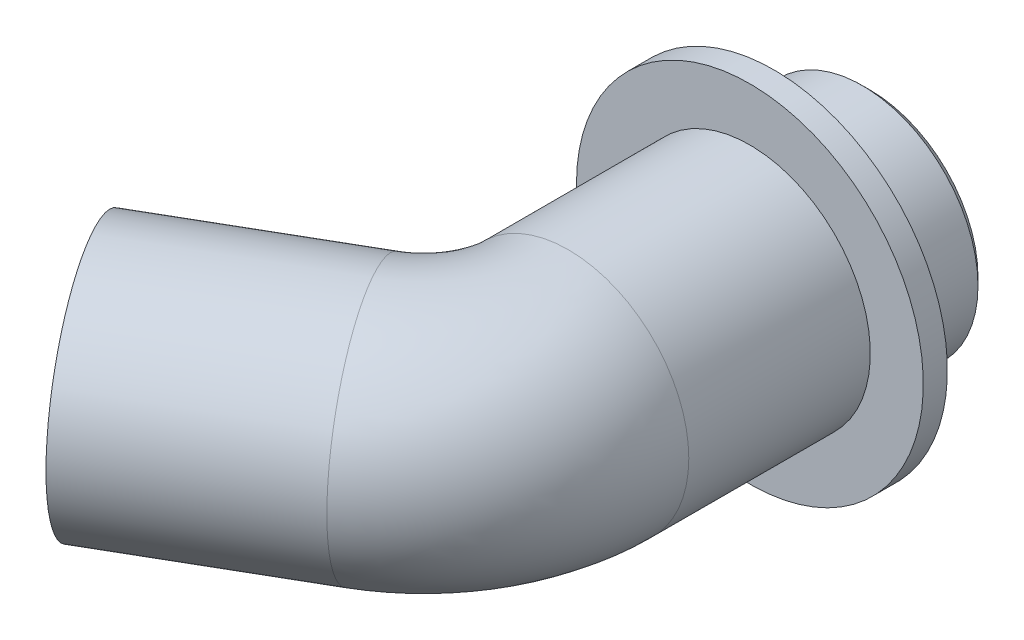
ISO-10303-21;
HEADER;
FILE_DESCRIPTION(('STEP AP214'),'2;1');
FILE_NAME('part.step','',(''),(''),'','','');
FILE_SCHEMA(('AUTOMOTIVE_DESIGN { 1 0 10303 214 1 1 1 1 }'));
ENDSEC;
DATA;
#1=APPLICATION_CONTEXT('core data for automotive mechanical design processes');
#2=APPLICATION_PROTOCOL_DEFINITION('international standard','automotive_design',2000,#1);
#3=PRODUCT_CONTEXT('',#1,'mechanical');
#4=PRODUCT('Part','Part','',(#3));
#5=PRODUCT_RELATED_PRODUCT_CATEGORY('part','',(#4));
#6=PRODUCT_DEFINITION_FORMATION('','',#4);
#7=PRODUCT_DEFINITION_CONTEXT('part definition',#1,'design');
#8=PRODUCT_DEFINITION('design','',#6,#7);
#9=PRODUCT_DEFINITION_SHAPE('','',#8);
#10=(LENGTH_UNIT() NAMED_UNIT(*) SI_UNIT(.MILLI.,.METRE.));
#11=(NAMED_UNIT(*) PLANE_ANGLE_UNIT() SI_UNIT($,.RADIAN.));
#12=(NAMED_UNIT(*) SI_UNIT($,.STERADIAN.) SOLID_ANGLE_UNIT());
#13=UNCERTAINTY_MEASURE_WITH_UNIT(LENGTH_MEASURE(1.E-05),#10,'distance_accuracy_value','');
#14=(GEOMETRIC_REPRESENTATION_CONTEXT(3) GLOBAL_UNCERTAINTY_ASSIGNED_CONTEXT((#13)) GLOBAL_UNIT_ASSIGNED_CONTEXT((#10,
#11,#12)) REPRESENTATION_CONTEXT('',''));
#15=CARTESIAN_POINT('',(0.,0.,0.));
#16=DIRECTION('',(0.,0.,1.));
#17=DIRECTION('',(1.,0.,0.));
#18=AXIS2_PLACEMENT_3D('',#15,#16,#17);
#19=CARTESIAN_POINT('',(0.,0.,0.));
#20=DIRECTION('',(0.,0.,1.));
#21=DIRECTION('',(1.,0.,0.));
#22=AXIS2_PLACEMENT_3D('',#19,#20,#21);
#23=PLANE('',#22);
#24=CARTESIAN_POINT('',(0.,0.,0.));
#25=DIRECTION('',(0.,0.,1.));
#26=DIRECTION('',(1.,0.,0.));
#27=AXIS2_PLACEMENT_3D('',#24,#25,#26);
#28=CIRCLE('',#27,22.352);
#29=CARTESIAN_POINT('',(22.352,0.,0.));
#30=VERTEX_POINT('',#29);
#31=EDGE_CURVE('E54',#30,#30,#28,.F.);
#32=ORIENTED_EDGE('',*,*,#31,.T.);
#33=EDGE_LOOP('',(#32));
#34=FACE_BOUND('',#33,.T.);
#35=CARTESIAN_POINT('',(0.,0.,0.));
#36=DIRECTION('',(0.,0.,1.));
#37=DIRECTION('',(1.,0.,0.));
#38=AXIS2_PLACEMENT_3D('',#35,#36,#37);
#39=CIRCLE('',#38,15.);
#40=CARTESIAN_POINT('',(15.,0.,0.));
#41=VERTEX_POINT('',#40);
#42=EDGE_CURVE('E77',#41,#41,#39,.T.);
#43=ORIENTED_EDGE('',*,*,#42,.T.);
#44=EDGE_LOOP('',(#43));
#45=FACE_BOUND('',#44,.T.);
#46=ADVANCED_FACE('F47',(#34,#45),#23,.F.);
#47=CARTESIAN_POINT('',(22.,0.,16.));
#48=DIRECTION('',(0.,0.,1.));
#49=DIRECTION('',(1.,0.,0.));
#50=AXIS2_PLACEMENT_3D('',#47,#48,#49);
#51=PLANE('',#50);
#52=CARTESIAN_POINT('',(1.66533453693773E-13,0.,16.));
#53=DIRECTION('',(0.,0.,-1.));
#54=DIRECTION('',(-1.,0.,0.));
#55=AXIS2_PLACEMENT_3D('',#52,#53,#54);
#56=CIRCLE('',#55,22.);
#57=CARTESIAN_POINT('',(-21.9999999999998,0.,16.));
#58=VERTEX_POINT('',#57);
#59=EDGE_CURVE('E94',#58,#58,#56,.T.);
#60=ORIENTED_EDGE('',*,*,#59,.T.);
#61=EDGE_LOOP('',(#60));
#62=FACE_BOUND('',#61,.T.);
#63=CARTESIAN_POINT('',(1.66533453693773E-13,0.,16.));
#64=DIRECTION('',(0.,0.,1.));
#65=DIRECTION('',(1.,0.,0.));
#66=AXIS2_PLACEMENT_3D('',#63,#64,#65);
#67=CIRCLE('',#66,24.);
#68=CARTESIAN_POINT('',(24.0000000000002,0.,16.));
#69=VERTEX_POINT('',#68);
#70=EDGE_CURVE('E97',#69,#69,#67,.F.);
#71=ORIENTED_EDGE('',*,*,#70,.F.);
#72=EDGE_LOOP('',(#71));
#73=FACE_BOUND('',#72,.T.);
#74=ADVANCED_FACE('F103',(#62,#73),#51,.T.);
#75=CARTESIAN_POINT('',(1.73472347597681E-13,0.,62.6794919243113));
#76=DIRECTION('',(0.,0.,-1.));
#77=DIRECTION('',(-1.,0.,0.));
#78=AXIS2_PLACEMENT_3D('',#75,#76,#77);
#79=CYLINDRICAL_SURFACE('',#78,25.);
#80=CARTESIAN_POINT('',(1.73472347597681E-13,0.,62.6794919243113));
#81=DIRECTION('',(0.,0.,1.));
#82=DIRECTION('',(1.,0.,0.));
#83=AXIS2_PLACEMENT_3D('',#80,#81,#82);
#84=CIRCLE('',#83,25.);
#85=CARTESIAN_POINT('',(25.0000000000001,0.,62.6794919243113));
#86=VERTEX_POINT('',#85);
#87=EDGE_CURVE('E76',#86,#86,#84,.T.);
#88=ORIENTED_EDGE('',*,*,#87,.F.);
#89=EDGE_LOOP('',(#88));
#90=FACE_BOUND('',#89,.T.);
#91=CARTESIAN_POINT('',(1.66533453693773E-13,0.,25.));
#92=DIRECTION('',(0.,0.,-1.));
#93=DIRECTION('',(-1.,0.,0.));
#94=AXIS2_PLACEMENT_3D('',#91,#92,#93);
#95=CIRCLE('',#94,25.);
#96=CARTESIAN_POINT('',(-24.9999999999998,0.,25.));
#97=VERTEX_POINT('',#96);
#98=EDGE_CURVE('E58',#97,#97,#95,.T.);
#99=ORIENTED_EDGE('',*,*,#98,.F.);
#100=EDGE_LOOP('',(#99));
#101=FACE_BOUND('',#100,.T.);
#102=ADVANCED_FACE('F105',(#90,#101),#79,.T.);
#103=CARTESIAN_POINT('',(-14.9999999999999,0.,88.6602540378444));
#104=DIRECTION('',(-0.866025403784438,0.,0.500000000000001));
#105=DIRECTION('',(0.500000000000001,0.,0.866025403784438));
#106=AXIS2_PLACEMENT_3D('',#103,#104,#105);
#107=CYLINDRICAL_SURFACE('',#106,25.);
#108=CARTESIAN_POINT('',(-14.9999999999999,0.,88.6602540378444));
#109=DIRECTION('',(-0.866025403784438,0.,0.500000000000001));
#110=DIRECTION('',(0.500000000000001,0.,0.866025403784438));
#111=AXIS2_PLACEMENT_3D('',#108,#109,#110);
#112=CIRCLE('',#111,25.);
#113=CARTESIAN_POINT('',(-2.49999999999992,0.,110.310889132455));
#114=VERTEX_POINT('',#113);
#115=EDGE_CURVE('E70',#114,#114,#112,.T.);
#116=ORIENTED_EDGE('',*,*,#115,.T.);
#117=EDGE_LOOP('',(#116));
#118=FACE_BOUND('',#117,.T.);
#119=CARTESIAN_POINT('',(-51.9615242270663,0.,110.));
#120=DIRECTION('',(-0.866025403784438,0.,0.500000000000001));
#121=DIRECTION('',(0.500000000000001,0.,0.866025403784438));
#122=AXIS2_PLACEMENT_3D('',#119,#120,#121);
#123=CIRCLE('',#122,25.);
#124=CARTESIAN_POINT('',(-39.4615242270662,0.,131.650635094611));
#125=VERTEX_POINT('',#124);
#126=EDGE_CURVE('E62',#125,#125,#123,.T.);
#127=ORIENTED_EDGE('',*,*,#126,.F.);
#128=EDGE_LOOP('',(#127));
#129=FACE_BOUND('',#128,.T.);
#130=ADVANCED_FACE('F112',(#118,#129),#107,.T.);
#131=CARTESIAN_POINT('',(-14.9999999999999,0.,88.6602540378444));
#132=DIRECTION('',(-0.866025403784438,0.,0.500000000000001));
#133=DIRECTION('',(0.500000000000001,0.,0.866025403784438));
#134=AXIS2_PLACEMENT_3D('',#131,#132,#133);
#135=CYLINDRICAL_SURFACE('',#134,15.);
#136=CARTESIAN_POINT('',(-14.9999999999999,0.,88.6602540378444));
#137=DIRECTION('',(-0.866025403784438,0.,0.500000000000001));
#138=DIRECTION('',(0.500000000000001,0.,0.866025403784438));
#139=AXIS2_PLACEMENT_3D('',#136,#137,#138);
#140=CIRCLE('',#139,15.);
#141=CARTESIAN_POINT('',(-7.49999999999992,0.,101.650635094611));
#142=VERTEX_POINT('',#141);
#143=EDGE_CURVE('E73',#142,#142,#140,.T.);
#144=ORIENTED_EDGE('',*,*,#143,.F.);
#145=EDGE_LOOP('',(#144));
#146=FACE_BOUND('',#145,.T.);
#147=CARTESIAN_POINT('',(-51.9615242270663,0.,110.));
#148=DIRECTION('',(-0.866025403784438,0.,0.500000000000001));
#149=DIRECTION('',(0.500000000000001,0.,0.866025403784438));
#150=AXIS2_PLACEMENT_3D('',#147,#148,#149);
#151=CIRCLE('',#150,15.);
#152=CARTESIAN_POINT('',(-44.4615242270662,0.,122.990381056767));
#153=VERTEX_POINT('',#152);
#154=EDGE_CURVE('E67',#153,#153,#151,.T.);
#155=ORIENTED_EDGE('',*,*,#154,.T.);
#156=EDGE_LOOP('',(#155));
#157=FACE_BOUND('',#156,.T.);
#158=ADVANCED_FACE('F149',(#146,#157),#135,.F.);
#159=CARTESIAN_POINT('',(-29.9999999999999,0.,62.6794919243113));
#160=DIRECTION('',(0.,-1.,0.));
#161=DIRECTION('',(0.,0.,-1.));
#162=AXIS2_PLACEMENT_3D('',#159,#160,#161);
#163=TOROIDAL_SURFACE('',#162,30.,25.);
#164=CARTESIAN_POINT('',(-29.9999999999999,0.,62.6794919243113));
#165=DIRECTION('',(0.,-1.,0.));
#166=DIRECTION('',(0.,0.,-1.));
#167=AXIS2_PLACEMENT_3D('',#164,#165,#166);
#168=CIRCLE('',#167,55.);
#169=EDGE_CURVE('',#86,#114,#168,.T.);
#170=ORIENTED_EDGE('',*,*,#87,.T.);
#171=ORIENTED_EDGE('',*,*,#115,.F.);
#172=ORIENTED_EDGE('',*,*,#169,.T.);
#173=ORIENTED_EDGE('',*,*,#169,.F.);
#174=EDGE_LOOP('',(#170,#172,#171,#173));
#175=FACE_BOUND('',#174,.T.);
#176=ADVANCED_FACE('F145',(#175),#163,.T.);
#177=CARTESIAN_POINT('',(-29.9999999999999,0.,62.6794919243113));
#178=DIRECTION('',(0.,-1.,0.));
#179=DIRECTION('',(0.,0.,-1.));
#180=AXIS2_PLACEMENT_3D('',#177,#178,#179);
#181=TOROIDAL_SURFACE('',#180,30.,15.);
#182=CARTESIAN_POINT('',(1.73472347597681E-13,0.,62.6794919243113));
#183=DIRECTION('',(0.,0.,1.));
#184=DIRECTION('',(1.,0.,0.));
#185=AXIS2_PLACEMENT_3D('',#182,#183,#184);
#186=CIRCLE('',#185,15.);
#187=CARTESIAN_POINT('',(15.0000000000001,0.,62.6794919243113));
#188=VERTEX_POINT('',#187);
#189=EDGE_CURVE('E80',#188,#188,#186,.T.);
#190=CARTESIAN_POINT('',(-29.9999999999999,0.,62.6794919243113));
#191=DIRECTION('',(0.,-1.,0.));
#192=DIRECTION('',(0.,0.,-1.));
#193=AXIS2_PLACEMENT_3D('',#190,#191,#192);
#194=CIRCLE('',#193,45.);
#195=EDGE_CURVE('',#188,#142,#194,.T.);
#196=ORIENTED_EDGE('',*,*,#189,.F.);
#197=ORIENTED_EDGE('',*,*,#143,.T.);
#198=ORIENTED_EDGE('',*,*,#195,.T.);
#199=ORIENTED_EDGE('',*,*,#195,.F.);
#200=EDGE_LOOP('',(#196,#198,#197,#199));
#201=FACE_BOUND('',#200,.T.);
#202=ADVANCED_FACE('F141',(#201),#181,.F.);
#203=CARTESIAN_POINT('',(1.73472347597681E-13,0.,62.6794919243113));
#204=DIRECTION('',(0.,0.,-1.));
#205=DIRECTION('',(-1.,0.,0.));
#206=AXIS2_PLACEMENT_3D('',#203,#204,#205);
#207=CYLINDRICAL_SURFACE('',#206,15.);
#208=ORIENTED_EDGE('',*,*,#189,.T.);
#209=EDGE_LOOP('',(#208));
#210=FACE_BOUND('',#209,.T.);
#211=ORIENTED_EDGE('',*,*,#42,.F.);
#212=EDGE_LOOP('',(#211));
#213=FACE_BOUND('',#212,.T.);
#214=ADVANCED_FACE('F136',(#210,#213),#207,.F.);
#215=CARTESIAN_POINT('',(-51.9615242270663,0.,110.));
#216=DIRECTION('',(-0.866025403784438,0.,0.500000000000001));
#217=DIRECTION('',(0.500000000000001,0.,0.866025403784438));
#218=AXIS2_PLACEMENT_3D('',#215,#216,#217);
#219=PLANE('',#218);
#220=ORIENTED_EDGE('',*,*,#154,.F.);
#221=EDGE_LOOP('',(#220));
#222=FACE_BOUND('',#221,.T.);
#223=ORIENTED_EDGE('',*,*,#126,.T.);
#224=EDGE_LOOP('',(#223));
#225=FACE_BOUND('',#224,.T.);
#226=ADVANCED_FACE('F133',(#222,#225),#219,.T.);
#227=CARTESIAN_POINT('',(1.66533453693773E-13,0.,25.));
#228=DIRECTION('',(0.,0.,-1.));
#229=DIRECTION('',(-1.,0.,0.));
#230=AXIS2_PLACEMENT_3D('',#227,#228,#229);
#231=CYLINDRICAL_SURFACE('',#230,36.);
#232=CARTESIAN_POINT('',(1.66533453693773E-13,0.,25.));
#233=DIRECTION('',(0.,0.,-1.));
#234=DIRECTION('',(-1.,0.,0.));
#235=AXIS2_PLACEMENT_3D('',#232,#233,#234);
#236=CIRCLE('',#235,36.);
#237=CARTESIAN_POINT('',(-35.9999999999998,0.,25.));
#238=VERTEX_POINT('',#237);
#239=EDGE_CURVE('E81',#238,#238,#236,.T.);
#240=ORIENTED_EDGE('',*,*,#239,.T.);
#241=EDGE_LOOP('',(#240));
#242=FACE_BOUND('',#241,.T.);
#243=CARTESIAN_POINT('',(1.66533453693773E-13,0.,20.));
#244=DIRECTION('',(0.,0.,-1.));
#245=DIRECTION('',(-1.,0.,0.));
#246=AXIS2_PLACEMENT_3D('',#243,#244,#245);
#247=CIRCLE('',#246,36.);
#248=CARTESIAN_POINT('',(-35.9999999999998,0.,20.));
#249=VERTEX_POINT('',#248);
#250=EDGE_CURVE('E86',#249,#249,#247,.T.);
#251=ORIENTED_EDGE('',*,*,#250,.F.);
#252=EDGE_LOOP('',(#251));
#253=FACE_BOUND('',#252,.T.);
#254=ADVANCED_FACE('F126',(#242,#253),#231,.T.);
#255=CARTESIAN_POINT('',(1.66533453693773E-13,0.,25.));
#256=DIRECTION('',(0.,0.,-1.));
#257=DIRECTION('',(-1.,0.,0.));
#258=AXIS2_PLACEMENT_3D('',#255,#256,#257);
#259=PLANE('',#258);
#260=ORIENTED_EDGE('',*,*,#98,.T.);
#261=EDGE_LOOP('',(#260));
#262=FACE_BOUND('',#261,.T.);
#263=ORIENTED_EDGE('',*,*,#239,.F.);
#264=EDGE_LOOP('',(#263));
#265=FACE_BOUND('',#264,.T.);
#266=ADVANCED_FACE('F123',(#262,#265),#259,.F.);
#267=CARTESIAN_POINT('',(1.66533453693773E-13,0.,20.));
#268=DIRECTION('',(0.,0.,-1.));
#269=DIRECTION('',(-1.,0.,0.));
#270=AXIS2_PLACEMENT_3D('',#267,#268,#269);
#271=PLANE('',#270);
#272=ORIENTED_EDGE('',*,*,#250,.T.);
#273=EDGE_LOOP('',(#272));
#274=FACE_BOUND('',#273,.T.);
#275=CARTESIAN_POINT('',(1.66533453693773E-13,0.,20.));
#276=DIRECTION('',(0.,0.,-1.));
#277=DIRECTION('',(-1.,0.,0.));
#278=AXIS2_PLACEMENT_3D('',#275,#276,#277);
#279=CIRCLE('',#278,22.);
#280=CARTESIAN_POINT('',(-21.9999999999998,0.,20.));
#281=VERTEX_POINT('',#280);
#282=EDGE_CURVE('E89',#281,#281,#279,.T.);
#283=ORIENTED_EDGE('',*,*,#282,.F.);
#284=EDGE_LOOP('',(#283));
#285=FACE_BOUND('',#284,.T.);
#286=ADVANCED_FACE('F121',(#274,#285),#271,.T.);
#287=CARTESIAN_POINT('',(0.,0.,0.));
#288=DIRECTION('',(0.,0.,-1.));
#289=DIRECTION('',(-1.,0.,0.));
#290=AXIS2_PLACEMENT_3D('',#287,#288,#289);
#291=CYLINDRICAL_SURFACE('',#290,22.);
#292=ORIENTED_EDGE('',*,*,#282,.T.);
#293=EDGE_LOOP('',(#292));
#294=FACE_BOUND('',#293,.T.);
#295=ORIENTED_EDGE('',*,*,#59,.F.);
#296=EDGE_LOOP('',(#295));
#297=FACE_BOUND('',#296,.T.);
#298=ADVANCED_FACE('F118',(#294,#297),#291,.T.);
#299=CARTESIAN_POINT('',(0.,0.,131.651635094611));
#300=DIRECTION('',(0.,0.,-1.));
#301=DIRECTION('',(-1.,0.,0.));
#302=AXIS2_PLACEMENT_3D('',#299,#300,#301);
#303=CYLINDRICAL_SURFACE('',#302,24.);
#304=CARTESIAN_POINT('',(0.,0.,1.64800000000004));
#305=DIRECTION('',(0.,0.,1.));
#306=DIRECTION('',(1.,0.,0.));
#307=AXIS2_PLACEMENT_3D('',#304,#305,#306);
#308=CIRCLE('',#307,24.);
#309=CARTESIAN_POINT('',(24.,0.,1.64800000000004));
#310=VERTEX_POINT('',#309);
#311=EDGE_CURVE('E12',#310,#310,#308,.T.);
#312=ORIENTED_EDGE('',*,*,#311,.T.);
#313=EDGE_LOOP('',(#312));
#314=FACE_BOUND('',#313,.T.);
#315=ORIENTED_EDGE('',*,*,#70,.T.);
#316=EDGE_LOOP('',(#315));
#317=FACE_BOUND('',#316,.T.);
#318=ADVANCED_FACE('F101',(#314,#317),#303,.T.);
#319=CARTESIAN_POINT('',(0.,0.,0.));
#320=DIRECTION('',(0.,0.,1.));
#321=DIRECTION('',(1.,0.,0.));
#322=AXIS2_PLACEMENT_3D('',#319,#320,#321);
#323=CONICAL_SURFACE('',#322,22.352,0.785398163397443);
#324=ORIENTED_EDGE('',*,*,#311,.F.);
#325=EDGE_LOOP('',(#324));
#326=FACE_BOUND('',#325,.T.);
#327=ORIENTED_EDGE('',*,*,#31,.F.);
#328=EDGE_LOOP('',(#327));
#329=FACE_BOUND('',#328,.T.);
#330=ADVANCED_FACE('F49',(#326,#329),#323,.T.);
#331=CLOSED_SHELL('',(#46,#74,#102,#130,#158,#176,#202,#214,#226,#254,#266,#286,#298,#318,#330));
#332=MANIFOLD_SOLID_BREP('B2',#331);
#333=ADVANCED_BREP_SHAPE_REPRESENTATION('',(#18,#332),#14);
#334=SHAPE_DEFINITION_REPRESENTATION(#9,#333);
ENDSEC;
END-ISO-10303-21;
